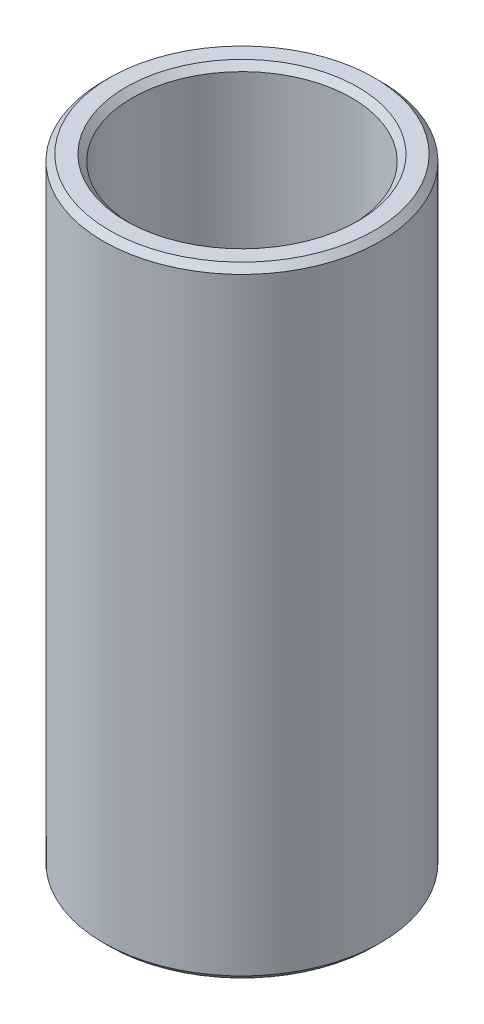
ISO-10303-21;
HEADER;
FILE_DESCRIPTION(('STEP AP214'),'2;1');
FILE_NAME('part.step','',(''),(''),'','','');
FILE_SCHEMA(('AUTOMOTIVE_DESIGN { 1 0 10303 214 1 1 1 1 }'));
ENDSEC;
DATA;
#1=APPLICATION_CONTEXT('core data for automotive mechanical design processes');
#2=APPLICATION_PROTOCOL_DEFINITION('international standard','automotive_design',2000,#1);
#3=PRODUCT_CONTEXT('',#1,'mechanical');
#4=PRODUCT('Part','Part','',(#3));
#5=PRODUCT_RELATED_PRODUCT_CATEGORY('part','',(#4));
#6=PRODUCT_DEFINITION_FORMATION('','',#4);
#7=PRODUCT_DEFINITION_CONTEXT('part definition',#1,'design');
#8=PRODUCT_DEFINITION('design','',#6,#7);
#9=PRODUCT_DEFINITION_SHAPE('','',#8);
#10=(LENGTH_UNIT() NAMED_UNIT(*) SI_UNIT(.MILLI.,.METRE.));
#11=(NAMED_UNIT(*) PLANE_ANGLE_UNIT() SI_UNIT($,.RADIAN.));
#12=(NAMED_UNIT(*) SI_UNIT($,.STERADIAN.) SOLID_ANGLE_UNIT());
#13=UNCERTAINTY_MEASURE_WITH_UNIT(LENGTH_MEASURE(1.E-05),#10,'distance_accuracy_value','');
#14=(GEOMETRIC_REPRESENTATION_CONTEXT(3) GLOBAL_UNCERTAINTY_ASSIGNED_CONTEXT((#13)) GLOBAL_UNIT_ASSIGNED_CONTEXT((#10,
#11,#12)) REPRESENTATION_CONTEXT('',''));
#15=CARTESIAN_POINT('',(0.,0.,0.));
#16=DIRECTION('',(0.,0.,1.));
#17=DIRECTION('',(1.,0.,0.));
#18=AXIS2_PLACEMENT_3D('',#15,#16,#17);
#19=CARTESIAN_POINT('',(0.,234.848804561109,0.));
#20=DIRECTION('',(0.,-1.,0.));
#21=DIRECTION('',(0.,0.,-1.));
#22=AXIS2_PLACEMENT_3D('',#19,#20,#21);
#23=CYLINDRICAL_SURFACE('',#22,52.5);
#24=CARTESIAN_POINT('',(0.,2.35670095372165,0.));
#25=DIRECTION('',(0.,1.,0.));
#26=DIRECTION('',(0.,0.,1.));
#27=AXIS2_PLACEMENT_3D('',#24,#25,#26);
#28=CIRCLE('',#27,52.5);
#29=CARTESIAN_POINT('',(0.,2.35670095372165,52.5));
#30=VERTEX_POINT('',#29);
#31=EDGE_CURVE('E10',#30,#30,#28,.T.);
#32=ORIENTED_EDGE('',*,*,#31,.T.);
#33=EDGE_LOOP('',(#32));
#34=FACE_BOUND('',#33,.T.);
#35=CARTESIAN_POINT('',(0.,232.492103607387,0.));
#36=DIRECTION('',(0.,1.,0.));
#37=DIRECTION('',(0.,0.,1.));
#38=AXIS2_PLACEMENT_3D('',#35,#36,#37);
#39=CIRCLE('',#38,52.5);
#40=CARTESIAN_POINT('',(0.,232.492103607387,52.5));
#41=VERTEX_POINT('',#40);
#42=EDGE_CURVE('E50',#41,#41,#39,.F.);
#43=ORIENTED_EDGE('',*,*,#42,.T.);
#44=EDGE_LOOP('',(#43));
#45=FACE_BOUND('',#44,.T.);
#46=ADVANCED_FACE('F39',(#34,#45),#23,.T.);
#47=CARTESIAN_POINT('',(0.,234.848804561109,0.));
#48=DIRECTION('',(0.,1.,0.));
#49=DIRECTION('',(0.,0.,1.));
#50=AXIS2_PLACEMENT_3D('',#47,#48,#49);
#51=PLANE('',#50);
#52=CARTESIAN_POINT('',(0.,234.848804561109,0.));
#53=DIRECTION('',(0.,1.,0.));
#54=DIRECTION('',(0.,0.,1.));
#55=AXIS2_PLACEMENT_3D('',#52,#53,#54);
#56=CIRCLE('',#55,43.9492903062801);
#57=CARTESIAN_POINT('',(0.,234.848804561109,43.9492903062801));
#58=VERTEX_POINT('',#57);
#59=EDGE_CURVE('E58',#58,#58,#56,.F.);
#60=ORIENTED_EDGE('',*,*,#59,.T.);
#61=EDGE_LOOP('',(#60));
#62=FACE_BOUND('',#61,.T.);
#63=CARTESIAN_POINT('',(0.,234.848804561109,0.));
#64=DIRECTION('',(0.,1.,0.));
#65=DIRECTION('',(0.,0.,1.));
#66=AXIS2_PLACEMENT_3D('',#63,#64,#65);
#67=CIRCLE('',#66,50.1432990462783);
#68=CARTESIAN_POINT('',(0.,234.848804561109,50.1432990462783));
#69=VERTEX_POINT('',#68);
#70=EDGE_CURVE('E61',#69,#69,#67,.T.);
#71=ORIENTED_EDGE('',*,*,#70,.T.);
#72=EDGE_LOOP('',(#71));
#73=FACE_BOUND('',#72,.T.);
#74=ADVANCED_FACE('F88',(#62,#73),#51,.T.);
#75=CARTESIAN_POINT('',(0.,0.,0.));
#76=DIRECTION('',(0.,1.,0.));
#77=DIRECTION('',(0.,0.,1.));
#78=AXIS2_PLACEMENT_3D('',#75,#76,#77);
#79=PLANE('',#78);
#80=CARTESIAN_POINT('',(0.,0.,0.));
#81=DIRECTION('',(0.,1.,0.));
#82=DIRECTION('',(0.,0.,1.));
#83=AXIS2_PLACEMENT_3D('',#80,#81,#82);
#84=CIRCLE('',#83,43.9492903062801);
#85=CARTESIAN_POINT('',(0.,0.,43.9492903062801));
#86=VERTEX_POINT('',#85);
#87=EDGE_CURVE('E51',#86,#86,#84,.T.);
#88=ORIENTED_EDGE('',*,*,#87,.T.);
#89=EDGE_LOOP('',(#88));
#90=FACE_BOUND('',#89,.T.);
#91=CARTESIAN_POINT('',(0.,0.,0.));
#92=DIRECTION('',(0.,1.,0.));
#93=DIRECTION('',(0.,0.,1.));
#94=AXIS2_PLACEMENT_3D('',#91,#92,#93);
#95=CIRCLE('',#94,50.1432990462783);
#96=CARTESIAN_POINT('',(0.,0.,50.1432990462783));
#97=VERTEX_POINT('',#96);
#98=EDGE_CURVE('E54',#97,#97,#95,.F.);
#99=ORIENTED_EDGE('',*,*,#98,.T.);
#100=EDGE_LOOP('',(#99));
#101=FACE_BOUND('',#100,.T.);
#102=ADVANCED_FACE('F83',(#90,#101),#79,.F.);
#103=CARTESIAN_POINT('',(0.,234.848804561109,0.));
#104=DIRECTION('',(0.,-1.,0.));
#105=DIRECTION('',(0.,0.,-1.));
#106=AXIS2_PLACEMENT_3D('',#103,#104,#105);
#107=CYLINDRICAL_SURFACE('',#106,41.5925893525584);
#108=CARTESIAN_POINT('',(0.,232.492103607387,0.));
#109=DIRECTION('',(0.,1.,0.));
#110=DIRECTION('',(0.,0.,1.));
#111=AXIS2_PLACEMENT_3D('',#108,#109,#110);
#112=CIRCLE('',#111,41.5925893525584);
#113=CARTESIAN_POINT('',(0.,232.492103607387,41.5925893525584));
#114=VERTEX_POINT('',#113);
#115=EDGE_CURVE('E67',#114,#114,#112,.T.);
#116=ORIENTED_EDGE('',*,*,#115,.T.);
#117=EDGE_LOOP('',(#116));
#118=FACE_BOUND('',#117,.T.);
#119=CARTESIAN_POINT('',(0.,2.35670095372176,0.));
#120=DIRECTION('',(0.,1.,0.));
#121=DIRECTION('',(0.,0.,1.));
#122=AXIS2_PLACEMENT_3D('',#119,#120,#121);
#123=CIRCLE('',#122,41.5925893525584);
#124=CARTESIAN_POINT('',(0.,2.35670095372176,41.5925893525584));
#125=VERTEX_POINT('',#124);
#126=EDGE_CURVE('E69',#125,#125,#123,.F.);
#127=ORIENTED_EDGE('',*,*,#126,.T.);
#128=EDGE_LOOP('',(#127));
#129=FACE_BOUND('',#128,.T.);
#130=ADVANCED_FACE('F71',(#118,#129),#107,.F.);
#131=CARTESIAN_POINT('',(0.,232.492103607387,0.));
#132=DIRECTION('',(0.,1.,0.));
#133=DIRECTION('',(0.,0.,1.));
#134=AXIS2_PLACEMENT_3D('',#131,#132,#133);
#135=CONICAL_SURFACE('',#134,41.5925893525584,0.785398163397447);
#136=ORIENTED_EDGE('',*,*,#59,.F.);
#137=EDGE_LOOP('',(#136));
#138=FACE_BOUND('',#137,.T.);
#139=ORIENTED_EDGE('',*,*,#115,.F.);
#140=EDGE_LOOP('',(#139));
#141=FACE_BOUND('',#140,.T.);
#142=ADVANCED_FACE('F77',(#138,#141),#135,.F.);
#143=CARTESIAN_POINT('',(0.,0.,0.));
#144=DIRECTION('',(0.,-1.,0.));
#145=DIRECTION('',(0.,0.,-1.));
#146=AXIS2_PLACEMENT_3D('',#143,#144,#145);
#147=CONICAL_SURFACE('',#146,43.9492903062801,0.785398163397447);
#148=ORIENTED_EDGE('',*,*,#126,.F.);
#149=EDGE_LOOP('',(#148));
#150=FACE_BOUND('',#149,.T.);
#151=ORIENTED_EDGE('',*,*,#87,.F.);
#152=EDGE_LOOP('',(#151));
#153=FACE_BOUND('',#152,.T.);
#154=ADVANCED_FACE('F73',(#150,#153),#147,.F.);
#155=CARTESIAN_POINT('',(0.,2.35670095372165,0.));
#156=DIRECTION('',(0.,1.,0.));
#157=DIRECTION('',(0.,0.,1.));
#158=AXIS2_PLACEMENT_3D('',#155,#156,#157);
#159=CONICAL_SURFACE('',#158,52.5,0.785398163397456);
#160=ORIENTED_EDGE('',*,*,#98,.F.);
#161=EDGE_LOOP('',(#160));
#162=FACE_BOUND('',#161,.T.);
#163=ORIENTED_EDGE('',*,*,#31,.F.);
#164=EDGE_LOOP('',(#163));
#165=FACE_BOUND('',#164,.T.);
#166=ADVANCED_FACE('F76',(#162,#165),#159,.T.);
#167=CARTESIAN_POINT('',(0.,234.848804561109,0.));
#168=DIRECTION('',(0.,-1.,0.));
#169=DIRECTION('',(0.,0.,-1.));
#170=AXIS2_PLACEMENT_3D('',#167,#168,#169);
#171=CONICAL_SURFACE('',#170,50.1432990462783,0.785398163397444);
#172=ORIENTED_EDGE('',*,*,#42,.F.);
#173=EDGE_LOOP('',(#172));
#174=FACE_BOUND('',#173,.T.);
#175=ORIENTED_EDGE('',*,*,#70,.F.);
#176=EDGE_LOOP('',(#175));
#177=FACE_BOUND('',#176,.T.);
#178=ADVANCED_FACE('F45',(#174,#177),#171,.T.);
#179=CLOSED_SHELL('',(#46,#74,#102,#130,#142,#154,#166,#178));
#180=MANIFOLD_SOLID_BREP('B2',#179);
#181=ADVANCED_BREP_SHAPE_REPRESENTATION('',(#18,#180),#14);
#182=SHAPE_DEFINITION_REPRESENTATION(#9,#181);
ENDSEC;
END-ISO-10303-21;
